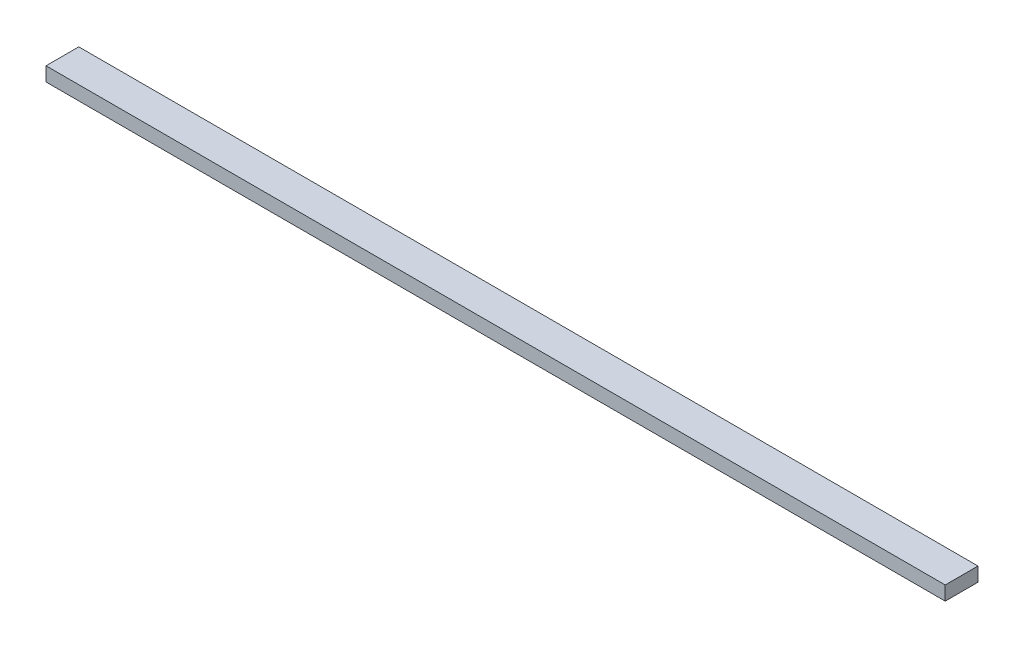
ISO-10303-21;
HEADER;
FILE_DESCRIPTION(('STEP AP214'),'2;1');
FILE_NAME('part.step','',(''),(''),'','','');
FILE_SCHEMA(('AUTOMOTIVE_DESIGN { 1 0 10303 214 1 1 1 1 }'));
ENDSEC;
DATA;
#1=APPLICATION_CONTEXT('core data for automotive mechanical design processes');
#2=APPLICATION_PROTOCOL_DEFINITION('international standard','automotive_design',2000,#1);
#3=PRODUCT_CONTEXT('',#1,'mechanical');
#4=PRODUCT('Part','Part','',(#3));
#5=PRODUCT_RELATED_PRODUCT_CATEGORY('part','',(#4));
#6=PRODUCT_DEFINITION_FORMATION('','',#4);
#7=PRODUCT_DEFINITION_CONTEXT('part definition',#1,'design');
#8=PRODUCT_DEFINITION('design','',#6,#7);
#9=PRODUCT_DEFINITION_SHAPE('','',#8);
#10=(LENGTH_UNIT() NAMED_UNIT(*) SI_UNIT(.MILLI.,.METRE.));
#11=(NAMED_UNIT(*) PLANE_ANGLE_UNIT() SI_UNIT($,.RADIAN.));
#12=(NAMED_UNIT(*) SI_UNIT($,.STERADIAN.) SOLID_ANGLE_UNIT());
#13=UNCERTAINTY_MEASURE_WITH_UNIT(LENGTH_MEASURE(1.E-05),#10,'distance_accuracy_value','');
#14=(GEOMETRIC_REPRESENTATION_CONTEXT(3) GLOBAL_UNCERTAINTY_ASSIGNED_CONTEXT((#13)) GLOBAL_UNIT_ASSIGNED_CONTEXT((#10,
#11,#12)) REPRESENTATION_CONTEXT('',''));
#15=CARTESIAN_POINT('',(0.,0.,0.));
#16=DIRECTION('',(0.,0.,1.));
#17=DIRECTION('',(1.,0.,0.));
#18=AXIS2_PLACEMENT_3D('',#15,#16,#17);
#19=CARTESIAN_POINT('',(0.,38.1,0.));
#20=DIRECTION('',(1.,0.,0.));
#21=DIRECTION('',(0.,0.,-1.));
#22=AXIS2_PLACEMENT_3D('',#19,#20,#21);
#23=PLANE('',#22);
#24=DIRECTION('',(0.,0.,1.));
#25=VECTOR('',#24,1.);
#26=CARTESIAN_POINT('',(0.,0.,0.));
#27=LINE('',#26,#25);
#28=CARTESIAN_POINT('',(0.,0.,0.));
#29=VERTEX_POINT('',#28);
#30=CARTESIAN_POINT('',(0.,0.,88.9));
#31=VERTEX_POINT('',#30);
#32=EDGE_CURVE('E95',#29,#31,#27,.T.);
#33=ORIENTED_EDGE('',*,*,#32,.T.);
#34=DIRECTION('',(0.,-1.,0.));
#35=VECTOR('',#34,1.);
#36=CARTESIAN_POINT('',(0.,38.1,88.9));
#37=LINE('',#36,#35);
#38=CARTESIAN_POINT('',(0.,38.1,88.9));
#39=VERTEX_POINT('',#38);
#40=EDGE_CURVE('E11',#39,#31,#37,.T.);
#41=ORIENTED_EDGE('',*,*,#40,.F.);
#42=DIRECTION('',(0.,0.,1.));
#43=VECTOR('',#42,1.);
#44=CARTESIAN_POINT('',(0.,38.1,0.));
#45=LINE('',#44,#43);
#46=CARTESIAN_POINT('',(0.,38.1,0.));
#47=VERTEX_POINT('',#46);
#48=EDGE_CURVE('E83',#47,#39,#45,.T.);
#49=ORIENTED_EDGE('',*,*,#48,.F.);
#50=DIRECTION('',(0.,-1.,0.));
#51=VECTOR('',#50,1.);
#52=CARTESIAN_POINT('',(0.,38.1,0.));
#53=LINE('',#52,#51);
#54=EDGE_CURVE('E91',#47,#29,#53,.T.);
#55=ORIENTED_EDGE('',*,*,#54,.T.);
#56=EDGE_LOOP('',(#33,#41,#49,#55));
#57=FACE_BOUND('',#56,.T.);
#58=ADVANCED_FACE('F32',(#57),#23,.F.);
#59=CARTESIAN_POINT('',(0.,38.1,88.9));
#60=DIRECTION('',(0.,0.,-1.));
#61=DIRECTION('',(-1.,0.,0.));
#62=AXIS2_PLACEMENT_3D('',#59,#60,#61);
#63=PLANE('',#62);
#64=DIRECTION('',(1.,0.,0.));
#65=VECTOR('',#64,1.);
#66=CARTESIAN_POINT('',(0.,0.,88.9));
#67=LINE('',#66,#65);
#68=CARTESIAN_POINT('',(2438.4,0.,88.9));
#69=VERTEX_POINT('',#68);
#70=EDGE_CURVE('E87',#31,#69,#67,.T.);
#71=ORIENTED_EDGE('',*,*,#70,.T.);
#72=DIRECTION('',(0.,-1.,0.));
#73=VECTOR('',#72,1.);
#74=CARTESIAN_POINT('',(2438.4,38.1,88.9));
#75=LINE('',#74,#73);
#76=CARTESIAN_POINT('',(2438.4,38.1,88.9));
#77=VERTEX_POINT('',#76);
#78=EDGE_CURVE('E40',#77,#69,#75,.T.);
#79=ORIENTED_EDGE('',*,*,#78,.F.);
#80=DIRECTION('',(1.,0.,0.));
#81=VECTOR('',#80,1.);
#82=CARTESIAN_POINT('',(0.,38.1,88.9));
#83=LINE('',#82,#81);
#84=EDGE_CURVE('E78',#39,#77,#83,.T.);
#85=ORIENTED_EDGE('',*,*,#84,.F.);
#86=ORIENTED_EDGE('',*,*,#40,.T.);
#87=EDGE_LOOP('',(#71,#79,#85,#86));
#88=FACE_BOUND('',#87,.T.);
#89=ADVANCED_FACE('F86',(#88),#63,.F.);
#90=CARTESIAN_POINT('',(2438.4,38.1,0.));
#91=DIRECTION('',(-1.,0.,0.));
#92=DIRECTION('',(0.,0.,1.));
#93=AXIS2_PLACEMENT_3D('',#90,#91,#92);
#94=PLANE('',#93);
#95=DIRECTION('',(0.,0.,-1.));
#96=VECTOR('',#95,1.);
#97=CARTESIAN_POINT('',(2438.4,0.,0.));
#98=LINE('',#97,#96);
#99=CARTESIAN_POINT('',(2438.4,0.,0.));
#100=VERTEX_POINT('',#99);
#101=EDGE_CURVE('E65',#69,#100,#98,.T.);
#102=ORIENTED_EDGE('',*,*,#101,.T.);
#103=DIRECTION('',(0.,-1.,0.));
#104=VECTOR('',#103,1.);
#105=CARTESIAN_POINT('',(2438.4,38.1,0.));
#106=LINE('',#105,#104);
#107=CARTESIAN_POINT('',(2438.4,38.1,0.));
#108=VERTEX_POINT('',#107);
#109=EDGE_CURVE('E88',#108,#100,#106,.T.);
#110=ORIENTED_EDGE('',*,*,#109,.F.);
#111=DIRECTION('',(0.,0.,-1.));
#112=VECTOR('',#111,1.);
#113=CARTESIAN_POINT('',(2438.4,38.1,0.));
#114=LINE('',#113,#112);
#115=EDGE_CURVE('E81',#77,#108,#114,.T.);
#116=ORIENTED_EDGE('',*,*,#115,.F.);
#117=ORIENTED_EDGE('',*,*,#78,.T.);
#118=EDGE_LOOP('',(#102,#110,#116,#117));
#119=FACE_BOUND('',#118,.T.);
#120=ADVANCED_FACE('F89',(#119),#94,.F.);
#121=CARTESIAN_POINT('',(0.,38.1,0.));
#122=DIRECTION('',(0.,0.,1.));
#123=DIRECTION('',(1.,0.,0.));
#124=AXIS2_PLACEMENT_3D('',#121,#122,#123);
#125=PLANE('',#124);
#126=DIRECTION('',(-1.,0.,0.));
#127=VECTOR('',#126,1.);
#128=CARTESIAN_POINT('',(0.,0.,0.));
#129=LINE('',#128,#127);
#130=EDGE_CURVE('E71',#100,#29,#129,.T.);
#131=ORIENTED_EDGE('',*,*,#130,.T.);
#132=ORIENTED_EDGE('',*,*,#54,.F.);
#133=DIRECTION('',(-1.,0.,0.));
#134=VECTOR('',#133,1.);
#135=CARTESIAN_POINT('',(0.,38.1,0.));
#136=LINE('',#135,#134);
#137=EDGE_CURVE('E48',#108,#47,#136,.T.);
#138=ORIENTED_EDGE('',*,*,#137,.F.);
#139=ORIENTED_EDGE('',*,*,#109,.T.);
#140=EDGE_LOOP('',(#131,#132,#138,#139));
#141=FACE_BOUND('',#140,.T.);
#142=ADVANCED_FACE('F102',(#141),#125,.F.);
#143=CARTESIAN_POINT('',(0.,38.1,0.));
#144=DIRECTION('',(0.,1.,0.));
#145=DIRECTION('',(0.,0.,1.));
#146=AXIS2_PLACEMENT_3D('',#143,#144,#145);
#147=PLANE('',#146);
#148=ORIENTED_EDGE('',*,*,#48,.T.);
#149=ORIENTED_EDGE('',*,*,#84,.T.);
#150=ORIENTED_EDGE('',*,*,#115,.T.);
#151=ORIENTED_EDGE('',*,*,#137,.T.);
#152=EDGE_LOOP('',(#148,#149,#150,#151));
#153=FACE_BOUND('',#152,.T.);
#154=ADVANCED_FACE('F79',(#153),#147,.T.);
#155=CARTESIAN_POINT('',(0.,0.,0.));
#156=DIRECTION('',(0.,1.,0.));
#157=DIRECTION('',(0.,0.,1.));
#158=AXIS2_PLACEMENT_3D('',#155,#156,#157);
#159=PLANE('',#158);
#160=ORIENTED_EDGE('',*,*,#32,.F.);
#161=ORIENTED_EDGE('',*,*,#130,.F.);
#162=ORIENTED_EDGE('',*,*,#101,.F.);
#163=ORIENTED_EDGE('',*,*,#70,.F.);
#164=EDGE_LOOP('',(#160,#161,#162,#163));
#165=FACE_BOUND('',#164,.T.);
#166=ADVANCED_FACE('F105',(#165),#159,.F.);
#167=CLOSED_SHELL('',(#58,#89,#120,#142,#154,#166));
#168=MANIFOLD_SOLID_BREP('B2',#167);
#169=ADVANCED_BREP_SHAPE_REPRESENTATION('',(#18,#168),#14);
#170=SHAPE_DEFINITION_REPRESENTATION(#9,#169);
ENDSEC;
END-ISO-10303-21;
